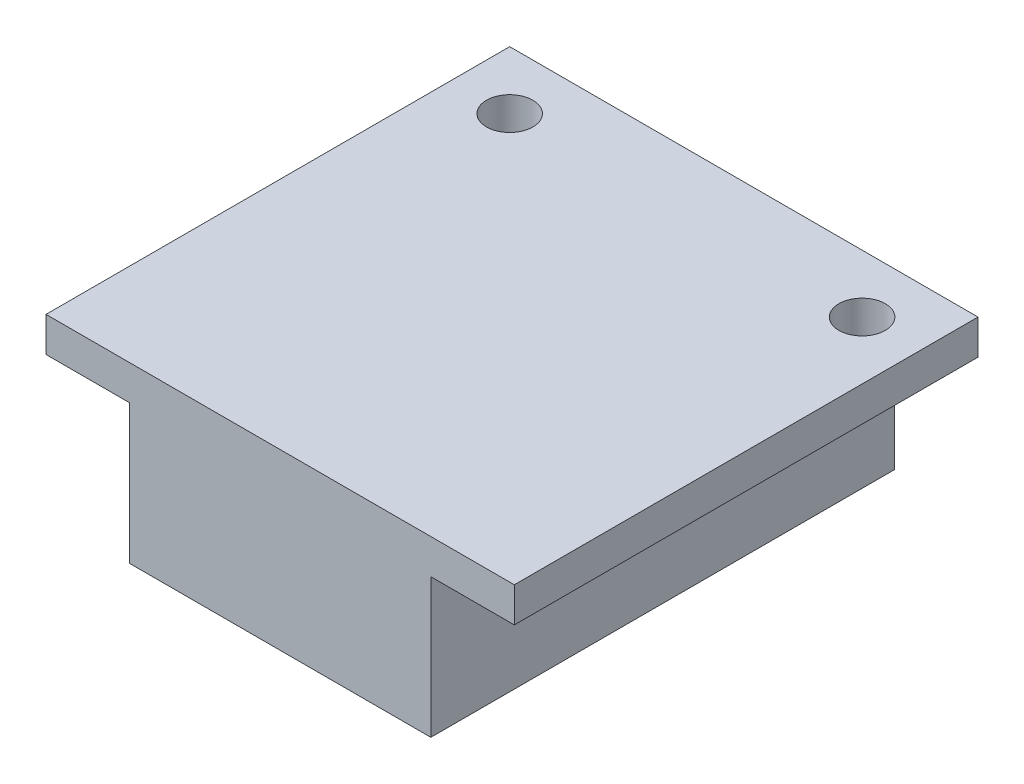
ISO-10303-21;
HEADER;
FILE_DESCRIPTION(('STEP AP214'),'2;1');
FILE_NAME('part.step','',(''),(''),'','','');
FILE_SCHEMA(('AUTOMOTIVE_DESIGN { 1 0 10303 214 1 1 1 1 }'));
ENDSEC;
DATA;
#1=APPLICATION_CONTEXT('core data for automotive mechanical design processes');
#2=APPLICATION_PROTOCOL_DEFINITION('international standard','automotive_design',2000,#1);
#3=PRODUCT_CONTEXT('',#1,'mechanical');
#4=PRODUCT('Part','Part','',(#3));
#5=PRODUCT_RELATED_PRODUCT_CATEGORY('part','',(#4));
#6=PRODUCT_DEFINITION_FORMATION('','',#4);
#7=PRODUCT_DEFINITION_CONTEXT('part definition',#1,'design');
#8=PRODUCT_DEFINITION('design','',#6,#7);
#9=PRODUCT_DEFINITION_SHAPE('','',#8);
#10=(LENGTH_UNIT() NAMED_UNIT(*) SI_UNIT(.MILLI.,.METRE.));
#11=(NAMED_UNIT(*) PLANE_ANGLE_UNIT() SI_UNIT($,.RADIAN.));
#12=(NAMED_UNIT(*) SI_UNIT($,.STERADIAN.) SOLID_ANGLE_UNIT());
#13=UNCERTAINTY_MEASURE_WITH_UNIT(LENGTH_MEASURE(1.E-05),#10,'distance_accuracy_value','');
#14=(GEOMETRIC_REPRESENTATION_CONTEXT(3) GLOBAL_UNCERTAINTY_ASSIGNED_CONTEXT((#13)) GLOBAL_UNIT_ASSIGNED_CONTEXT((#10,
#11,#12)) REPRESENTATION_CONTEXT('',''));
#15=CARTESIAN_POINT('',(0.,0.,0.));
#16=DIRECTION('',(0.,0.,1.));
#17=DIRECTION('',(1.,0.,0.));
#18=AXIS2_PLACEMENT_3D('',#15,#16,#17);
#19=CARTESIAN_POINT('',(-16.2597014925373,-0.447761194029851,-20.));
#20=DIRECTION('',(0.,-1.,0.));
#21=DIRECTION('',(0.,0.,-1.));
#22=AXIS2_PLACEMENT_3D('',#19,#20,#21);
#23=PLANE('',#22);
#24=CARTESIAN_POINT('',(-13.7597014925373,-0.447761194029851,-17.5));
#25=DIRECTION('',(0.,-1.,0.));
#26=DIRECTION('',(0.,0.,-1.));
#27=AXIS2_PLACEMENT_3D('',#24,#25,#26);
#28=CIRCLE('',#27,1.);
#29=CARTESIAN_POINT('',(-13.7597014925373,-0.447761194029851,-18.5));
#30=VERTEX_POINT('',#29);
#31=EDGE_CURVE('E248',#30,#30,#28,.T.);
#32=ORIENTED_EDGE('',*,*,#31,.F.);
#33=EDGE_LOOP('',(#32));
#34=FACE_BOUND('',#33,.T.);
#35=DIRECTION('',(1.,0.,0.));
#36=VECTOR('',#35,1.);
#37=CARTESIAN_POINT('',(-16.2597014925373,-0.447761194029851,-20.));
#38=LINE('',#37,#36);
#39=CARTESIAN_POINT('',(-16.2597014925373,-0.447761194029851,-20.));
#40=VERTEX_POINT('',#39);
#41=CARTESIAN_POINT('',(-12.6597014925373,-0.447761194029851,-20.));
#42=VERTEX_POINT('',#41);
#43=EDGE_CURVE('E168',#40,#42,#38,.T.);
#44=ORIENTED_EDGE('',*,*,#43,.T.);
#45=DIRECTION('',(0.,0.,1.));
#46=VECTOR('',#45,1.);
#47=CARTESIAN_POINT('',(-12.6597014925373,-0.447761194029851,-20.));
#48=LINE('',#47,#46);
#49=CARTESIAN_POINT('',(-12.6597014925373,-0.447761194029851,0.));
#50=VERTEX_POINT('',#49);
#51=EDGE_CURVE('E159',#42,#50,#48,.T.);
#52=ORIENTED_EDGE('',*,*,#51,.T.);
#53=DIRECTION('',(1.,0.,0.));
#54=VECTOR('',#53,1.);
#55=CARTESIAN_POINT('',(-16.2597014925373,-0.447761194029851,0.));
#56=LINE('',#55,#54);
#57=CARTESIAN_POINT('',(-16.2597014925373,-0.447761194029851,0.));
#58=VERTEX_POINT('',#57);
#59=EDGE_CURVE('E182',#58,#50,#56,.T.);
#60=ORIENTED_EDGE('',*,*,#59,.F.);
#61=DIRECTION('',(0.,0.,1.));
#62=VECTOR('',#61,1.);
#63=CARTESIAN_POINT('',(-16.2597014925373,-0.447761194029851,-20.));
#64=LINE('',#63,#62);
#65=EDGE_CURVE('E45',#40,#58,#64,.T.);
#66=ORIENTED_EDGE('',*,*,#65,.F.);
#67=EDGE_LOOP('',(#44,#52,#60,#66));
#68=FACE_BOUND('',#67,.T.);
#69=ADVANCED_FACE('F41',(#34,#68),#23,.T.);
#70=CARTESIAN_POINT('',(-16.2597014925373,1.05223880597015,-20.));
#71=DIRECTION('',(-1.,0.,0.));
#72=DIRECTION('',(0.,0.,1.));
#73=AXIS2_PLACEMENT_3D('',#70,#71,#72);
#74=PLANE('',#73);
#75=DIRECTION('',(0.,-1.,0.));
#76=VECTOR('',#75,1.);
#77=CARTESIAN_POINT('',(-16.2597014925373,1.05223880597015,0.));
#78=LINE('',#77,#76);
#79=CARTESIAN_POINT('',(-16.2597014925373,1.05223880597015,0.));
#80=VERTEX_POINT('',#79);
#81=EDGE_CURVE('E158',#80,#58,#78,.T.);
#82=ORIENTED_EDGE('',*,*,#81,.F.);
#83=DIRECTION('',(0.,0.,1.));
#84=VECTOR('',#83,1.);
#85=CARTESIAN_POINT('',(-16.2597014925373,1.05223880597015,-20.));
#86=LINE('',#85,#84);
#87=CARTESIAN_POINT('',(-16.2597014925373,1.05223880597015,-20.));
#88=VERTEX_POINT('',#87);
#89=EDGE_CURVE('E11',#88,#80,#86,.T.);
#90=ORIENTED_EDGE('',*,*,#89,.F.);
#91=DIRECTION('',(0.,-1.,0.));
#92=VECTOR('',#91,1.);
#93=CARTESIAN_POINT('',(-16.2597014925373,1.05223880597015,-20.));
#94=LINE('',#93,#92);
#95=EDGE_CURVE('E164',#88,#40,#94,.T.);
#96=ORIENTED_EDGE('',*,*,#95,.T.);
#97=ORIENTED_EDGE('',*,*,#65,.T.);
#98=EDGE_LOOP('',(#82,#90,#96,#97));
#99=FACE_BOUND('',#98,.T.);
#100=ADVANCED_FACE('F43',(#99),#74,.T.);
#101=CARTESIAN_POINT('',(-16.2597014925373,1.05223880597015,-20.));
#102=DIRECTION('',(0.,1.,0.));
#103=DIRECTION('',(0.,0.,1.));
#104=AXIS2_PLACEMENT_3D('',#101,#102,#103);
#105=PLANE('',#104);
#106=CARTESIAN_POINT('',(1.44029850746268,1.05223880597015,-17.5));
#107=DIRECTION('',(0.,-1.,0.));
#108=DIRECTION('',(0.,0.,-1.));
#109=AXIS2_PLACEMENT_3D('',#106,#107,#108);
#110=CIRCLE('',#109,1.);
#111=CARTESIAN_POINT('',(1.44029850746268,1.05223880597015,-18.5));
#112=VERTEX_POINT('',#111);
#113=EDGE_CURVE('E151',#112,#112,#110,.T.);
#114=ORIENTED_EDGE('',*,*,#113,.T.);
#115=EDGE_LOOP('',(#114));
#116=FACE_BOUND('',#115,.T.);
#117=CARTESIAN_POINT('',(-13.7597014925373,1.05223880597015,-17.5));
#118=DIRECTION('',(0.,-1.,0.));
#119=DIRECTION('',(0.,0.,-1.));
#120=AXIS2_PLACEMENT_3D('',#117,#118,#119);
#121=CIRCLE('',#120,1.);
#122=CARTESIAN_POINT('',(-13.7597014925373,1.05223880597015,-18.5));
#123=VERTEX_POINT('',#122);
#124=EDGE_CURVE('E241',#123,#123,#121,.T.);
#125=ORIENTED_EDGE('',*,*,#124,.T.);
#126=EDGE_LOOP('',(#125));
#127=FACE_BOUND('',#126,.T.);
#128=DIRECTION('',(-1.,0.,0.));
#129=VECTOR('',#128,1.);
#130=CARTESIAN_POINT('',(-16.2597014925373,1.05223880597015,0.));
#131=LINE('',#130,#129);
#132=CARTESIAN_POINT('',(3.94029850746268,1.05223880597015,0.));
#133=VERTEX_POINT('',#132);
#134=EDGE_CURVE('E167',#133,#80,#131,.T.);
#135=ORIENTED_EDGE('',*,*,#134,.F.);
#136=DIRECTION('',(0.,0.,1.));
#137=VECTOR('',#136,1.);
#138=CARTESIAN_POINT('',(3.94029850746268,1.05223880597015,-20.));
#139=LINE('',#138,#137);
#140=CARTESIAN_POINT('',(3.94029850746268,1.05223880597015,-20.));
#141=VERTEX_POINT('',#140);
#142=EDGE_CURVE('E51',#141,#133,#139,.T.);
#143=ORIENTED_EDGE('',*,*,#142,.F.);
#144=DIRECTION('',(-1.,0.,0.));
#145=VECTOR('',#144,1.);
#146=CARTESIAN_POINT('',(-16.2597014925373,1.05223880597015,-20.));
#147=LINE('',#146,#145);
#148=EDGE_CURVE('E175',#141,#88,#147,.T.);
#149=ORIENTED_EDGE('',*,*,#148,.T.);
#150=ORIENTED_EDGE('',*,*,#89,.T.);
#151=EDGE_LOOP('',(#135,#143,#149,#150));
#152=FACE_BOUND('',#151,.T.);
#153=ADVANCED_FACE('F204',(#116,#127,#152),#105,.T.);
#154=CARTESIAN_POINT('',(3.94029850746268,1.05223880597015,-20.));
#155=DIRECTION('',(1.,0.,0.));
#156=DIRECTION('',(0.,0.,-1.));
#157=AXIS2_PLACEMENT_3D('',#154,#155,#156);
#158=PLANE('',#157);
#159=DIRECTION('',(0.,1.,0.));
#160=VECTOR('',#159,1.);
#161=CARTESIAN_POINT('',(3.94029850746268,1.05223880597015,0.));
#162=LINE('',#161,#160);
#163=CARTESIAN_POINT('',(3.94029850746268,-0.447761194029851,0.));
#164=VERTEX_POINT('',#163);
#165=EDGE_CURVE('E186',#164,#133,#162,.T.);
#166=ORIENTED_EDGE('',*,*,#165,.F.);
#167=DIRECTION('',(0.,0.,1.));
#168=VECTOR('',#167,1.);
#169=CARTESIAN_POINT('',(3.94029850746268,-0.447761194029851,-20.));
#170=LINE('',#169,#168);
#171=CARTESIAN_POINT('',(3.94029850746268,-0.447761194029851,-20.));
#172=VERTEX_POINT('',#171);
#173=EDGE_CURVE('E194',#172,#164,#170,.T.);
#174=ORIENTED_EDGE('',*,*,#173,.F.);
#175=DIRECTION('',(0.,1.,0.));
#176=VECTOR('',#175,1.);
#177=CARTESIAN_POINT('',(3.94029850746268,1.05223880597015,-20.));
#178=LINE('',#177,#176);
#179=EDGE_CURVE('E171',#172,#141,#178,.T.);
#180=ORIENTED_EDGE('',*,*,#179,.T.);
#181=ORIENTED_EDGE('',*,*,#142,.T.);
#182=EDGE_LOOP('',(#166,#174,#180,#181));
#183=FACE_BOUND('',#182,.T.);
#184=ADVANCED_FACE('F207',(#183),#158,.T.);
#185=CARTESIAN_POINT('',(1.44029850746268,-0.447761194029851,-17.5));
#186=DIRECTION('',(0.,-1.,0.));
#187=DIRECTION('',(0.,0.,-1.));
#188=AXIS2_PLACEMENT_3D('',#185,#186,#187);
#189=CIRCLE('',#188,1.);
#190=CARTESIAN_POINT('',(1.44029850746268,-0.447761194029851,-18.5));
#191=VERTEX_POINT('',#190);
#192=EDGE_CURVE('E236',#191,#191,#189,.T.);
#193=ORIENTED_EDGE('',*,*,#192,.F.);
#194=EDGE_LOOP('',(#193));
#195=FACE_BOUND('',#194,.T.);
#196=DIRECTION('',(0.,0.,1.));
#197=VECTOR('',#196,1.);
#198=CARTESIAN_POINT('',(0.340298507462686,-0.447761194029851,-20.));
#199=LINE('',#198,#197);
#200=CARTESIAN_POINT('',(0.340298507462686,-0.447761194029851,-20.));
#201=VERTEX_POINT('',#200);
#202=CARTESIAN_POINT('',(0.340298507462686,-0.447761194029851,0.));
#203=VERTEX_POINT('',#202);
#204=EDGE_CURVE('E127',#201,#203,#199,.T.);
#205=ORIENTED_EDGE('',*,*,#204,.F.);
#206=EDGE_CURVE('E141',#201,#172,#38,.T.);
#207=ORIENTED_EDGE('',*,*,#206,.T.);
#208=ORIENTED_EDGE('',*,*,#173,.T.);
#209=EDGE_CURVE('E181',#203,#164,#56,.T.);
#210=ORIENTED_EDGE('',*,*,#209,.F.);
#211=EDGE_LOOP('',(#205,#207,#208,#210));
#212=FACE_BOUND('',#211,.T.);
#213=ADVANCED_FACE('F221',(#195,#212),#23,.T.);
#214=CARTESIAN_POINT('',(0.,0.,-20.));
#215=DIRECTION('',(0.,0.,1.));
#216=DIRECTION('',(1.,0.,0.));
#217=AXIS2_PLACEMENT_3D('',#214,#215,#216);
#218=PLANE('',#217);
#219=ORIENTED_EDGE('',*,*,#95,.F.);
#220=ORIENTED_EDGE('',*,*,#148,.F.);
#221=ORIENTED_EDGE('',*,*,#179,.F.);
#222=ORIENTED_EDGE('',*,*,#206,.F.);
#223=DIRECTION('',(0.,1.,0.));
#224=VECTOR('',#223,1.);
#225=CARTESIAN_POINT('',(0.340298507462686,0.,-20.));
#226=LINE('',#225,#224);
#227=CARTESIAN_POINT('',(0.340298507462686,-6.44776119402985,-20.));
#228=VERTEX_POINT('',#227);
#229=EDGE_CURVE('E119',#228,#201,#226,.T.);
#230=ORIENTED_EDGE('',*,*,#229,.F.);
#231=DIRECTION('',(-1.,0.,0.));
#232=VECTOR('',#231,1.);
#233=CARTESIAN_POINT('',(0.,-6.44776119402985,-20.));
#234=LINE('',#233,#232);
#235=CARTESIAN_POINT('',(-12.6597014925373,-6.44776119402985,-20.));
#236=VERTEX_POINT('',#235);
#237=EDGE_CURVE('E132',#228,#236,#234,.T.);
#238=ORIENTED_EDGE('',*,*,#237,.T.);
#239=DIRECTION('',(0.,1.,0.));
#240=VECTOR('',#239,1.);
#241=CARTESIAN_POINT('',(-12.6597014925373,0.,-20.));
#242=LINE('',#241,#240);
#243=EDGE_CURVE('E128',#236,#42,#242,.T.);
#244=ORIENTED_EDGE('',*,*,#243,.T.);
#245=ORIENTED_EDGE('',*,*,#43,.F.);
#246=EDGE_LOOP('',(#219,#220,#221,#222,#230,#238,#244,#245));
#247=FACE_BOUND('',#246,.T.);
#248=ADVANCED_FACE('F139',(#247),#218,.F.);
#249=CARTESIAN_POINT('',(0.,0.,0.));
#250=DIRECTION('',(0.,0.,1.));
#251=DIRECTION('',(1.,0.,0.));
#252=AXIS2_PLACEMENT_3D('',#249,#250,#251);
#253=PLANE('',#252);
#254=ORIENTED_EDGE('',*,*,#81,.T.);
#255=ORIENTED_EDGE('',*,*,#59,.T.);
#256=DIRECTION('',(0.,1.,0.));
#257=VECTOR('',#256,1.);
#258=CARTESIAN_POINT('',(-12.6597014925373,0.,0.));
#259=LINE('',#258,#257);
#260=CARTESIAN_POINT('',(-12.6597014925373,-6.44776119402985,0.));
#261=VERTEX_POINT('',#260);
#262=EDGE_CURVE('E59',#261,#50,#259,.T.);
#263=ORIENTED_EDGE('',*,*,#262,.F.);
#264=DIRECTION('',(-1.,0.,0.));
#265=VECTOR('',#264,1.);
#266=CARTESIAN_POINT('',(0.,-6.44776119402985,0.));
#267=LINE('',#266,#265);
#268=CARTESIAN_POINT('',(0.340298507462686,-6.44776119402985,0.));
#269=VERTEX_POINT('',#268);
#270=EDGE_CURVE('E148',#269,#261,#267,.T.);
#271=ORIENTED_EDGE('',*,*,#270,.F.);
#272=DIRECTION('',(0.,1.,0.));
#273=VECTOR('',#272,1.);
#274=CARTESIAN_POINT('',(0.340298507462686,0.,0.));
#275=LINE('',#274,#273);
#276=EDGE_CURVE('E122',#269,#203,#275,.T.);
#277=ORIENTED_EDGE('',*,*,#276,.T.);
#278=ORIENTED_EDGE('',*,*,#209,.T.);
#279=ORIENTED_EDGE('',*,*,#165,.T.);
#280=ORIENTED_EDGE('',*,*,#134,.T.);
#281=EDGE_LOOP('',(#254,#255,#263,#271,#277,#278,#279,#280));
#282=FACE_BOUND('',#281,.T.);
#283=ADVANCED_FACE('F203',(#282),#253,.T.);
#284=CARTESIAN_POINT('',(0.,-6.44776119402985,-20.));
#285=DIRECTION('',(0.,1.,0.));
#286=DIRECTION('',(-1.,0.,0.));
#287=AXIS2_PLACEMENT_3D('',#284,#285,#286);
#288=PLANE('',#287);
#289=ORIENTED_EDGE('',*,*,#270,.T.);
#290=DIRECTION('',(0.,0.,1.));
#291=VECTOR('',#290,1.);
#292=CARTESIAN_POINT('',(-12.6597014925373,-6.44776119402985,-20.));
#293=LINE('',#292,#291);
#294=EDGE_CURVE('E134',#236,#261,#293,.T.);
#295=ORIENTED_EDGE('',*,*,#294,.F.);
#296=ORIENTED_EDGE('',*,*,#237,.F.);
#297=DIRECTION('',(0.,0.,1.));
#298=VECTOR('',#297,1.);
#299=CARTESIAN_POINT('',(0.340298507462686,-6.44776119402985,-20.));
#300=LINE('',#299,#298);
#301=EDGE_CURVE('E115',#228,#269,#300,.T.);
#302=ORIENTED_EDGE('',*,*,#301,.T.);
#303=EDGE_LOOP('',(#289,#295,#296,#302));
#304=FACE_BOUND('',#303,.T.);
#305=ADVANCED_FACE('F133',(#304),#288,.F.);
#306=CARTESIAN_POINT('',(-12.6597014925373,0.,-20.));
#307=DIRECTION('',(1.,0.,0.));
#308=DIRECTION('',(0.,0.,-1.));
#309=AXIS2_PLACEMENT_3D('',#306,#307,#308);
#310=PLANE('',#309);
#311=ORIENTED_EDGE('',*,*,#262,.T.);
#312=ORIENTED_EDGE('',*,*,#51,.F.);
#313=ORIENTED_EDGE('',*,*,#243,.F.);
#314=ORIENTED_EDGE('',*,*,#294,.T.);
#315=EDGE_LOOP('',(#311,#312,#313,#314));
#316=FACE_BOUND('',#315,.T.);
#317=ADVANCED_FACE('F208',(#316),#310,.F.);
#318=CARTESIAN_POINT('',(0.340298507462686,0.,-20.));
#319=DIRECTION('',(1.,0.,0.));
#320=DIRECTION('',(0.,1.,0.));
#321=AXIS2_PLACEMENT_3D('',#318,#319,#320);
#322=PLANE('',#321);
#323=ORIENTED_EDGE('',*,*,#276,.F.);
#324=ORIENTED_EDGE('',*,*,#301,.F.);
#325=ORIENTED_EDGE('',*,*,#229,.T.);
#326=ORIENTED_EDGE('',*,*,#204,.T.);
#327=EDGE_LOOP('',(#323,#324,#325,#326));
#328=FACE_BOUND('',#327,.T.);
#329=ADVANCED_FACE('F117',(#328),#322,.T.);
#330=CARTESIAN_POINT('',(1.44029850746268,1.05223880597015,-17.5));
#331=DIRECTION('',(0.,-1.,0.));
#332=DIRECTION('',(0.,0.,-1.));
#333=AXIS2_PLACEMENT_3D('',#330,#331,#332);
#334=CYLINDRICAL_SURFACE('',#333,1.);
#335=ORIENTED_EDGE('',*,*,#113,.F.);
#336=EDGE_LOOP('',(#335));
#337=FACE_BOUND('',#336,.T.);
#338=ORIENTED_EDGE('',*,*,#192,.T.);
#339=EDGE_LOOP('',(#338));
#340=FACE_BOUND('',#339,.T.);
#341=ADVANCED_FACE('F215',(#337,#340),#334,.F.);
#342=CARTESIAN_POINT('',(-13.7597014925373,1.05223880597015,-17.5));
#343=DIRECTION('',(0.,-1.,0.));
#344=DIRECTION('',(0.,0.,-1.));
#345=AXIS2_PLACEMENT_3D('',#342,#343,#344);
#346=CYLINDRICAL_SURFACE('',#345,1.);
#347=ORIENTED_EDGE('',*,*,#124,.F.);
#348=EDGE_LOOP('',(#347));
#349=FACE_BOUND('',#348,.T.);
#350=ORIENTED_EDGE('',*,*,#31,.T.);
#351=EDGE_LOOP('',(#350));
#352=FACE_BOUND('',#351,.T.);
#353=ADVANCED_FACE('F253',(#349,#352),#346,.F.);
#354=CLOSED_SHELL('',(#69,#100,#153,#184,#213,#248,#283,#305,#317,#329,#341,#353));
#355=MANIFOLD_SOLID_BREP('B2',#354);
#356=ADVANCED_BREP_SHAPE_REPRESENTATION('',(#18,#355),#14);
#357=SHAPE_DEFINITION_REPRESENTATION(#9,#356);
ENDSEC;
END-ISO-10303-21;
